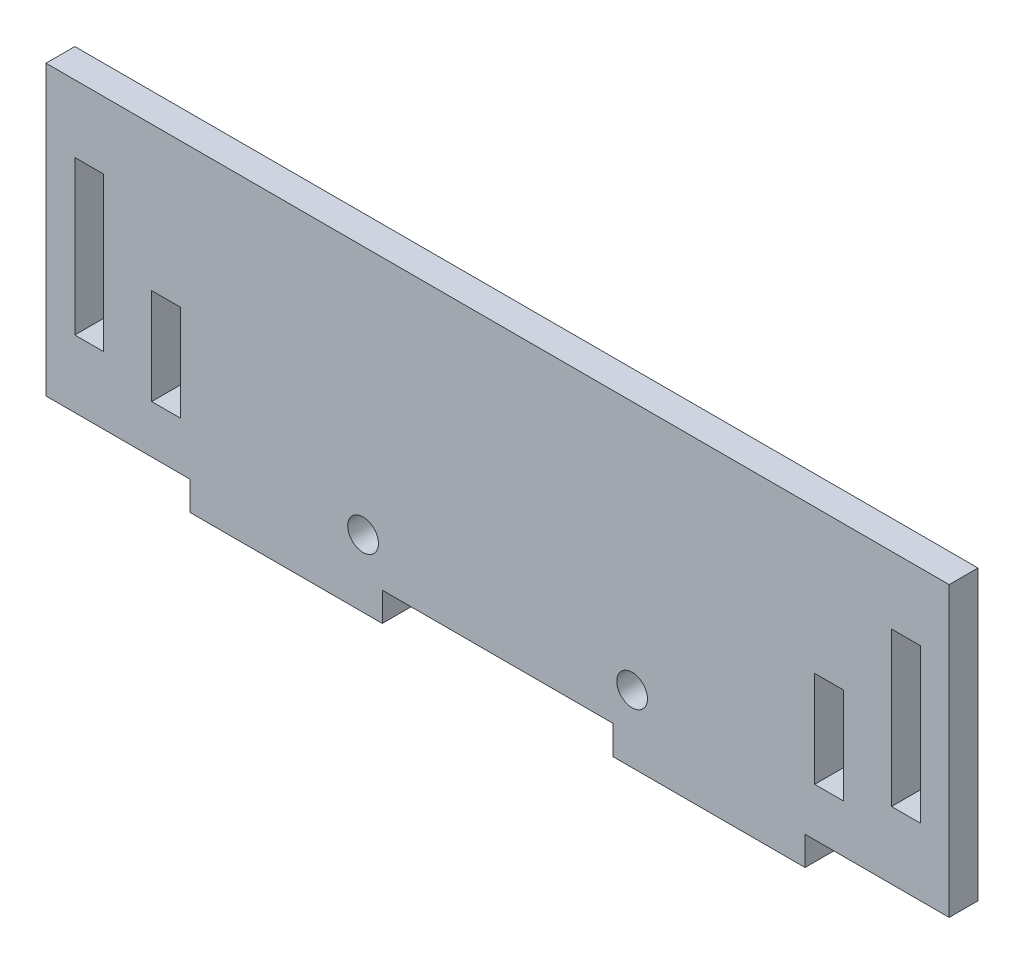
ISO-10303-21;
HEADER;
FILE_DESCRIPTION(('STEP AP214'),'2;1');
FILE_NAME('part.step','',(''),(''),'','','');
FILE_SCHEMA(('AUTOMOTIVE_DESIGN { 1 0 10303 214 1 1 1 1 }'));
ENDSEC;
DATA;
#1=APPLICATION_CONTEXT('core data for automotive mechanical design processes');
#2=APPLICATION_PROTOCOL_DEFINITION('international standard','automotive_design',2000,#1);
#3=PRODUCT_CONTEXT('',#1,'mechanical');
#4=PRODUCT('Part','Part','',(#3));
#5=PRODUCT_RELATED_PRODUCT_CATEGORY('part','',(#4));
#6=PRODUCT_DEFINITION_FORMATION('','',#4);
#7=PRODUCT_DEFINITION_CONTEXT('part definition',#1,'design');
#8=PRODUCT_DEFINITION('design','',#6,#7);
#9=PRODUCT_DEFINITION_SHAPE('','',#8);
#10=(LENGTH_UNIT() NAMED_UNIT(*) SI_UNIT(.MILLI.,.METRE.));
#11=(NAMED_UNIT(*) PLANE_ANGLE_UNIT() SI_UNIT($,.RADIAN.));
#12=(NAMED_UNIT(*) SI_UNIT($,.STERADIAN.) SOLID_ANGLE_UNIT());
#13=UNCERTAINTY_MEASURE_WITH_UNIT(LENGTH_MEASURE(1.E-05),#10,'distance_accuracy_value','');
#14=(GEOMETRIC_REPRESENTATION_CONTEXT(3) GLOBAL_UNCERTAINTY_ASSIGNED_CONTEXT((#13)) GLOBAL_UNIT_ASSIGNED_CONTEXT((#10,
#11,#12)) REPRESENTATION_CONTEXT('',''));
#15=CARTESIAN_POINT('',(0.,0.,0.));
#16=DIRECTION('',(0.,0.,1.));
#17=DIRECTION('',(1.,0.,0.));
#18=AXIS2_PLACEMENT_3D('',#15,#16,#17);
#19=CARTESIAN_POINT('',(0.,0.,3.));
#20=DIRECTION('',(-1.,0.,0.));
#21=DIRECTION('',(0.,0.,1.));
#22=AXIS2_PLACEMENT_3D('',#19,#20,#21);
#23=PLANE('',#22);
#24=DIRECTION('',(0.,1.,0.));
#25=VECTOR('',#24,1.);
#26=CARTESIAN_POINT('',(0.,0.,0.));
#27=LINE('',#26,#25);
#28=CARTESIAN_POINT('',(0.,7.,0.));
#29=VERTEX_POINT('',#28);
#30=CARTESIAN_POINT('',(0.,23.,0.));
#31=VERTEX_POINT('',#30);
#32=EDGE_CURVE('E329',#29,#31,#27,.T.);
#33=ORIENTED_EDGE('',*,*,#32,.T.);
#34=DIRECTION('',(0.,0.,-1.));
#35=VECTOR('',#34,1.);
#36=CARTESIAN_POINT('',(0.,23.,3.));
#37=LINE('',#36,#35);
#38=CARTESIAN_POINT('',(0.,23.,3.));
#39=VERTEX_POINT('',#38);
#40=EDGE_CURVE('E11',#39,#31,#37,.T.);
#41=ORIENTED_EDGE('',*,*,#40,.F.);
#42=DIRECTION('',(0.,1.,0.));
#43=VECTOR('',#42,1.);
#44=CARTESIAN_POINT('',(0.,0.,3.));
#45=LINE('',#44,#43);
#46=CARTESIAN_POINT('',(0.,7.,3.));
#47=VERTEX_POINT('',#46);
#48=EDGE_CURVE('E234',#47,#39,#45,.T.);
#49=ORIENTED_EDGE('',*,*,#48,.F.);
#50=DIRECTION('',(0.,0.,-1.));
#51=VECTOR('',#50,1.);
#52=CARTESIAN_POINT('',(0.,7.,3.));
#53=LINE('',#52,#51);
#54=EDGE_CURVE('E54',#47,#29,#53,.T.);
#55=ORIENTED_EDGE('',*,*,#54,.T.);
#56=EDGE_LOOP('',(#33,#41,#49,#55));
#57=FACE_BOUND('',#56,.T.);
#58=ADVANCED_FACE('F35',(#57),#23,.F.);
#59=CARTESIAN_POINT('',(0.,23.,3.));
#60=DIRECTION('',(0.,1.,0.));
#61=DIRECTION('',(0.,0.,1.));
#62=AXIS2_PLACEMENT_3D('',#59,#60,#61);
#63=PLANE('',#62);
#64=DIRECTION('',(1.,0.,0.));
#65=VECTOR('',#64,1.);
#66=CARTESIAN_POINT('',(0.,23.,0.));
#67=LINE('',#66,#65);
#68=CARTESIAN_POINT('',(3.,23.,0.));
#69=VERTEX_POINT('',#68);
#70=EDGE_CURVE('E240',#31,#69,#67,.T.);
#71=ORIENTED_EDGE('',*,*,#70,.T.);
#72=DIRECTION('',(0.,0.,-1.));
#73=VECTOR('',#72,1.);
#74=CARTESIAN_POINT('',(3.,23.,3.));
#75=LINE('',#74,#73);
#76=CARTESIAN_POINT('',(3.,23.,3.));
#77=VERTEX_POINT('',#76);
#78=EDGE_CURVE('E45',#77,#69,#75,.T.);
#79=ORIENTED_EDGE('',*,*,#78,.F.);
#80=DIRECTION('',(1.,0.,0.));
#81=VECTOR('',#80,1.);
#82=CARTESIAN_POINT('',(0.,23.,3.));
#83=LINE('',#82,#81);
#84=EDGE_CURVE('E228',#39,#77,#83,.T.);
#85=ORIENTED_EDGE('',*,*,#84,.F.);
#86=ORIENTED_EDGE('',*,*,#40,.T.);
#87=EDGE_LOOP('',(#71,#79,#85,#86));
#88=FACE_BOUND('',#87,.T.);
#89=ADVANCED_FACE('F239',(#88),#63,.F.);
#90=CARTESIAN_POINT('',(3.,0.,3.));
#91=DIRECTION('',(-1.,0.,0.));
#92=DIRECTION('',(0.,0.,1.));
#93=AXIS2_PLACEMENT_3D('',#90,#91,#92);
#94=PLANE('',#93);
#95=DIRECTION('',(0.,1.,0.));
#96=VECTOR('',#95,1.);
#97=CARTESIAN_POINT('',(3.,0.,0.));
#98=LINE('',#97,#96);
#99=CARTESIAN_POINT('',(3.,7.,0.));
#100=VERTEX_POINT('',#99);
#101=EDGE_CURVE('E332',#100,#69,#98,.T.);
#102=ORIENTED_EDGE('',*,*,#101,.F.);
#103=DIRECTION('',(0.,0.,-1.));
#104=VECTOR('',#103,1.);
#105=CARTESIAN_POINT('',(3.,7.,3.));
#106=LINE('',#105,#104);
#107=CARTESIAN_POINT('',(3.,7.,3.));
#108=VERTEX_POINT('',#107);
#109=EDGE_CURVE('E140',#108,#100,#106,.T.);
#110=ORIENTED_EDGE('',*,*,#109,.F.);
#111=DIRECTION('',(0.,1.,0.));
#112=VECTOR('',#111,1.);
#113=CARTESIAN_POINT('',(3.,0.,3.));
#114=LINE('',#113,#112);
#115=EDGE_CURVE('E233',#108,#77,#114,.T.);
#116=ORIENTED_EDGE('',*,*,#115,.T.);
#117=ORIENTED_EDGE('',*,*,#78,.T.);
#118=EDGE_LOOP('',(#102,#110,#116,#117));
#119=FACE_BOUND('',#118,.T.);
#120=ADVANCED_FACE('F244',(#119),#94,.T.);
#121=CARTESIAN_POINT('',(8.,0.,3.));
#122=DIRECTION('',(1.,0.,0.));
#123=DIRECTION('',(0.,0.,-1.));
#124=AXIS2_PLACEMENT_3D('',#121,#122,#123);
#125=PLANE('',#124);
#126=DIRECTION('',(0.,-1.,0.));
#127=VECTOR('',#126,1.);
#128=CARTESIAN_POINT('',(8.,0.,0.));
#129=LINE('',#128,#127);
#130=CARTESIAN_POINT('',(8.,15.,0.));
#131=VERTEX_POINT('',#130);
#132=CARTESIAN_POINT('',(8.,5.,0.));
#133=VERTEX_POINT('',#132);
#134=EDGE_CURVE('E317',#131,#133,#129,.T.);
#135=ORIENTED_EDGE('',*,*,#134,.F.);
#136=DIRECTION('',(0.,0.,-1.));
#137=VECTOR('',#136,1.);
#138=CARTESIAN_POINT('',(8.,15.,3.));
#139=LINE('',#138,#137);
#140=CARTESIAN_POINT('',(8.,15.,3.));
#141=VERTEX_POINT('',#140);
#142=EDGE_CURVE('E339',#141,#131,#139,.T.);
#143=ORIENTED_EDGE('',*,*,#142,.F.);
#144=DIRECTION('',(0.,-1.,0.));
#145=VECTOR('',#144,1.);
#146=CARTESIAN_POINT('',(8.,0.,3.));
#147=LINE('',#146,#145);
#148=CARTESIAN_POINT('',(8.,5.,3.));
#149=VERTEX_POINT('',#148);
#150=EDGE_CURVE('E492',#141,#149,#147,.T.);
#151=ORIENTED_EDGE('',*,*,#150,.T.);
#152=DIRECTION('',(0.,0.,-1.));
#153=VECTOR('',#152,1.);
#154=CARTESIAN_POINT('',(8.,5.,3.));
#155=LINE('',#154,#153);
#156=EDGE_CURVE('E341',#149,#133,#155,.T.);
#157=ORIENTED_EDGE('',*,*,#156,.T.);
#158=EDGE_LOOP('',(#135,#143,#151,#157));
#159=FACE_BOUND('',#158,.T.);
#160=ADVANCED_FACE('F518',(#159),#125,.T.);
#161=CARTESIAN_POINT('',(0.,15.,3.));
#162=DIRECTION('',(0.,1.,0.));
#163=DIRECTION('',(0.,0.,1.));
#164=AXIS2_PLACEMENT_3D('',#161,#162,#163);
#165=PLANE('',#164);
#166=DIRECTION('',(1.,0.,0.));
#167=VECTOR('',#166,1.);
#168=CARTESIAN_POINT('',(0.,15.,0.));
#169=LINE('',#168,#167);
#170=CARTESIAN_POINT('',(11.,15.,0.));
#171=VERTEX_POINT('',#170);
#172=EDGE_CURVE('E320',#131,#171,#169,.T.);
#173=ORIENTED_EDGE('',*,*,#172,.T.);
#174=DIRECTION('',(0.,0.,-1.));
#175=VECTOR('',#174,1.);
#176=CARTESIAN_POINT('',(11.,15.,3.));
#177=LINE('',#176,#175);
#178=CARTESIAN_POINT('',(11.,15.,3.));
#179=VERTEX_POINT('',#178);
#180=EDGE_CURVE('E346',#179,#171,#177,.T.);
#181=ORIENTED_EDGE('',*,*,#180,.F.);
#182=DIRECTION('',(1.,0.,0.));
#183=VECTOR('',#182,1.);
#184=CARTESIAN_POINT('',(0.,15.,3.));
#185=LINE('',#184,#183);
#186=EDGE_CURVE('E495',#141,#179,#185,.T.);
#187=ORIENTED_EDGE('',*,*,#186,.F.);
#188=ORIENTED_EDGE('',*,*,#142,.T.);
#189=EDGE_LOOP('',(#173,#181,#187,#188));
#190=FACE_BOUND('',#189,.T.);
#191=ADVANCED_FACE('F520',(#190),#165,.F.);
#192=CARTESIAN_POINT('',(11.,0.,3.));
#193=DIRECTION('',(1.,0.,0.));
#194=DIRECTION('',(0.,0.,-1.));
#195=AXIS2_PLACEMENT_3D('',#192,#193,#194);
#196=PLANE('',#195);
#197=DIRECTION('',(0.,-1.,0.));
#198=VECTOR('',#197,1.);
#199=CARTESIAN_POINT('',(11.,0.,0.));
#200=LINE('',#199,#198);
#201=CARTESIAN_POINT('',(11.,5.,0.));
#202=VERTEX_POINT('',#201);
#203=EDGE_CURVE('E323',#171,#202,#200,.T.);
#204=ORIENTED_EDGE('',*,*,#203,.T.);
#205=DIRECTION('',(0.,0.,-1.));
#206=VECTOR('',#205,1.);
#207=CARTESIAN_POINT('',(11.,5.,3.));
#208=LINE('',#207,#206);
#209=CARTESIAN_POINT('',(11.,5.,3.));
#210=VERTEX_POINT('',#209);
#211=EDGE_CURVE('E343',#210,#202,#208,.T.);
#212=ORIENTED_EDGE('',*,*,#211,.F.);
#213=DIRECTION('',(0.,-1.,0.));
#214=VECTOR('',#213,1.);
#215=CARTESIAN_POINT('',(11.,0.,3.));
#216=LINE('',#215,#214);
#217=EDGE_CURVE('E498',#179,#210,#216,.T.);
#218=ORIENTED_EDGE('',*,*,#217,.F.);
#219=ORIENTED_EDGE('',*,*,#180,.T.);
#220=EDGE_LOOP('',(#204,#212,#218,#219));
#221=FACE_BOUND('',#220,.T.);
#222=ADVANCED_FACE('F512',(#221),#196,.F.);
#223=CARTESIAN_POINT('',(0.,23.,3.));
#224=DIRECTION('',(0.,-1.,0.));
#225=DIRECTION('',(0.,0.,-1.));
#226=AXIS2_PLACEMENT_3D('',#223,#224,#225);
#227=PLANE('',#226);
#228=DIRECTION('',(-1.,0.,0.));
#229=VECTOR('',#228,1.);
#230=CARTESIAN_POINT('',(0.,23.,0.));
#231=LINE('',#230,#229);
#232=CARTESIAN_POINT('',(88.,23.,0.));
#233=VERTEX_POINT('',#232);
#234=CARTESIAN_POINT('',(85.,23.,0.));
#235=VERTEX_POINT('',#234);
#236=EDGE_CURVE('E305',#233,#235,#231,.T.);
#237=ORIENTED_EDGE('',*,*,#236,.F.);
#238=DIRECTION('',(0.,0.,-1.));
#239=VECTOR('',#238,1.);
#240=CARTESIAN_POINT('',(88.,23.,3.));
#241=LINE('',#240,#239);
#242=CARTESIAN_POINT('',(88.,23.,3.));
#243=VERTEX_POINT('',#242);
#244=EDGE_CURVE('E344',#243,#233,#241,.T.);
#245=ORIENTED_EDGE('',*,*,#244,.F.);
#246=DIRECTION('',(-1.,0.,0.));
#247=VECTOR('',#246,1.);
#248=CARTESIAN_POINT('',(0.,23.,3.));
#249=LINE('',#248,#247);
#250=CARTESIAN_POINT('',(85.,23.,3.));
#251=VERTEX_POINT('',#250);
#252=EDGE_CURVE('E481',#243,#251,#249,.T.);
#253=ORIENTED_EDGE('',*,*,#252,.T.);
#254=DIRECTION('',(0.,0.,-1.));
#255=VECTOR('',#254,1.);
#256=CARTESIAN_POINT('',(85.,23.,3.));
#257=LINE('',#256,#255);
#258=EDGE_CURVE('E350',#251,#235,#257,.T.);
#259=ORIENTED_EDGE('',*,*,#258,.T.);
#260=EDGE_LOOP('',(#237,#245,#253,#259));
#261=FACE_BOUND('',#260,.T.);
#262=ADVANCED_FACE('F527',(#261),#227,.T.);
#263=CARTESIAN_POINT('',(88.,0.,3.));
#264=DIRECTION('',(-1.,0.,0.));
#265=DIRECTION('',(0.,0.,1.));
#266=AXIS2_PLACEMENT_3D('',#263,#264,#265);
#267=PLANE('',#266);
#268=DIRECTION('',(0.,1.,0.));
#269=VECTOR('',#268,1.);
#270=CARTESIAN_POINT('',(88.,0.,0.));
#271=LINE('',#270,#269);
#272=CARTESIAN_POINT('',(88.,7.,0.));
#273=VERTEX_POINT('',#272);
#274=EDGE_CURVE('E308',#273,#233,#271,.T.);
#275=ORIENTED_EDGE('',*,*,#274,.F.);
#276=DIRECTION('',(0.,0.,-1.));
#277=VECTOR('',#276,1.);
#278=CARTESIAN_POINT('',(88.,7.,3.));
#279=LINE('',#278,#277);
#280=CARTESIAN_POINT('',(88.,7.,3.));
#281=VERTEX_POINT('',#280);
#282=EDGE_CURVE('E355',#281,#273,#279,.T.);
#283=ORIENTED_EDGE('',*,*,#282,.F.);
#284=DIRECTION('',(0.,1.,0.));
#285=VECTOR('',#284,1.);
#286=CARTESIAN_POINT('',(88.,0.,3.));
#287=LINE('',#286,#285);
#288=EDGE_CURVE('E484',#281,#243,#287,.T.);
#289=ORIENTED_EDGE('',*,*,#288,.T.);
#290=ORIENTED_EDGE('',*,*,#244,.T.);
#291=EDGE_LOOP('',(#275,#283,#289,#290));
#292=FACE_BOUND('',#291,.T.);
#293=ADVANCED_FACE('F626',(#292),#267,.T.);
#294=CARTESIAN_POINT('',(0.,7.,3.));
#295=DIRECTION('',(0.,-1.,0.));
#296=DIRECTION('',(0.,0.,-1.));
#297=AXIS2_PLACEMENT_3D('',#294,#295,#296);
#298=PLANE('',#297);
#299=DIRECTION('',(-1.,0.,0.));
#300=VECTOR('',#299,1.);
#301=CARTESIAN_POINT('',(0.,7.,0.));
#302=LINE('',#301,#300);
#303=CARTESIAN_POINT('',(85.,7.,0.));
#304=VERTEX_POINT('',#303);
#305=EDGE_CURVE('E311',#273,#304,#302,.T.);
#306=ORIENTED_EDGE('',*,*,#305,.T.);
#307=DIRECTION('',(0.,0.,-1.));
#308=VECTOR('',#307,1.);
#309=CARTESIAN_POINT('',(85.,7.,3.));
#310=LINE('',#309,#308);
#311=CARTESIAN_POINT('',(85.,7.,3.));
#312=VERTEX_POINT('',#311);
#313=EDGE_CURVE('E352',#312,#304,#310,.T.);
#314=ORIENTED_EDGE('',*,*,#313,.F.);
#315=DIRECTION('',(-1.,0.,0.));
#316=VECTOR('',#315,1.);
#317=CARTESIAN_POINT('',(0.,7.,3.));
#318=LINE('',#317,#316);
#319=EDGE_CURVE('E487',#281,#312,#318,.T.);
#320=ORIENTED_EDGE('',*,*,#319,.F.);
#321=ORIENTED_EDGE('',*,*,#282,.T.);
#322=EDGE_LOOP('',(#306,#314,#320,#321));
#323=FACE_BOUND('',#322,.T.);
#324=ADVANCED_FACE('F637',(#323),#298,.F.);
#325=CARTESIAN_POINT('',(0.,15.,3.));
#326=DIRECTION('',(0.,-1.,0.));
#327=DIRECTION('',(0.,0.,-1.));
#328=AXIS2_PLACEMENT_3D('',#325,#326,#327);
#329=PLANE('',#328);
#330=DIRECTION('',(-1.,0.,0.));
#331=VECTOR('',#330,1.);
#332=CARTESIAN_POINT('',(0.,15.,0.));
#333=LINE('',#332,#331);
#334=CARTESIAN_POINT('',(80.,15.,0.));
#335=VERTEX_POINT('',#334);
#336=CARTESIAN_POINT('',(77.,15.,0.));
#337=VERTEX_POINT('',#336);
#338=EDGE_CURVE('E293',#335,#337,#333,.T.);
#339=ORIENTED_EDGE('',*,*,#338,.F.);
#340=DIRECTION('',(0.,0.,-1.));
#341=VECTOR('',#340,1.);
#342=CARTESIAN_POINT('',(80.,15.,3.));
#343=LINE('',#342,#341);
#344=CARTESIAN_POINT('',(80.,15.,3.));
#345=VERTEX_POINT('',#344);
#346=EDGE_CURVE('E353',#345,#335,#343,.T.);
#347=ORIENTED_EDGE('',*,*,#346,.F.);
#348=DIRECTION('',(-1.,0.,0.));
#349=VECTOR('',#348,1.);
#350=CARTESIAN_POINT('',(0.,15.,3.));
#351=LINE('',#350,#349);
#352=CARTESIAN_POINT('',(77.,15.,3.));
#353=VERTEX_POINT('',#352);
#354=EDGE_CURVE('E470',#345,#353,#351,.T.);
#355=ORIENTED_EDGE('',*,*,#354,.T.);
#356=DIRECTION('',(0.,0.,-1.));
#357=VECTOR('',#356,1.);
#358=CARTESIAN_POINT('',(77.,15.,3.));
#359=LINE('',#358,#357);
#360=EDGE_CURVE('E358',#353,#337,#359,.T.);
#361=ORIENTED_EDGE('',*,*,#360,.T.);
#362=EDGE_LOOP('',(#339,#347,#355,#361));
#363=FACE_BOUND('',#362,.T.);
#364=ADVANCED_FACE('F648',(#363),#329,.T.);
#365=CARTESIAN_POINT('',(80.,0.,3.));
#366=DIRECTION('',(1.,0.,0.));
#367=DIRECTION('',(0.,0.,-1.));
#368=AXIS2_PLACEMENT_3D('',#365,#366,#367);
#369=PLANE('',#368);
#370=DIRECTION('',(0.,-1.,0.));
#371=VECTOR('',#370,1.);
#372=CARTESIAN_POINT('',(80.,0.,0.));
#373=LINE('',#372,#371);
#374=CARTESIAN_POINT('',(80.,5.,0.));
#375=VERTEX_POINT('',#374);
#376=EDGE_CURVE('E296',#335,#375,#373,.T.);
#377=ORIENTED_EDGE('',*,*,#376,.T.);
#378=DIRECTION('',(0.,0.,-1.));
#379=VECTOR('',#378,1.);
#380=CARTESIAN_POINT('',(80.,5.,3.));
#381=LINE('',#380,#379);
#382=CARTESIAN_POINT('',(80.,5.,3.));
#383=VERTEX_POINT('',#382);
#384=EDGE_CURVE('E362',#383,#375,#381,.T.);
#385=ORIENTED_EDGE('',*,*,#384,.F.);
#386=DIRECTION('',(0.,-1.,0.));
#387=VECTOR('',#386,1.);
#388=CARTESIAN_POINT('',(80.,0.,3.));
#389=LINE('',#388,#387);
#390=EDGE_CURVE('E473',#345,#383,#389,.T.);
#391=ORIENTED_EDGE('',*,*,#390,.F.);
#392=ORIENTED_EDGE('',*,*,#346,.T.);
#393=EDGE_LOOP('',(#377,#385,#391,#392));
#394=FACE_BOUND('',#393,.T.);
#395=ADVANCED_FACE('F658',(#394),#369,.F.);
#396=CARTESIAN_POINT('',(0.,5.,3.));
#397=DIRECTION('',(0.,-1.,0.));
#398=DIRECTION('',(0.,0.,-1.));
#399=AXIS2_PLACEMENT_3D('',#396,#397,#398);
#400=PLANE('',#399);
#401=DIRECTION('',(-1.,0.,0.));
#402=VECTOR('',#401,1.);
#403=CARTESIAN_POINT('',(0.,5.,0.));
#404=LINE('',#403,#402);
#405=CARTESIAN_POINT('',(77.,5.,0.));
#406=VERTEX_POINT('',#405);
#407=EDGE_CURVE('E299',#375,#406,#404,.T.);
#408=ORIENTED_EDGE('',*,*,#407,.T.);
#409=DIRECTION('',(0.,0.,-1.));
#410=VECTOR('',#409,1.);
#411=CARTESIAN_POINT('',(77.,5.,3.));
#412=LINE('',#411,#410);
#413=CARTESIAN_POINT('',(77.,5.,3.));
#414=VERTEX_POINT('',#413);
#415=EDGE_CURVE('E360',#414,#406,#412,.T.);
#416=ORIENTED_EDGE('',*,*,#415,.F.);
#417=DIRECTION('',(-1.,0.,0.));
#418=VECTOR('',#417,1.);
#419=CARTESIAN_POINT('',(0.,5.,3.));
#420=LINE('',#419,#418);
#421=EDGE_CURVE('E476',#383,#414,#420,.T.);
#422=ORIENTED_EDGE('',*,*,#421,.F.);
#423=ORIENTED_EDGE('',*,*,#384,.T.);
#424=EDGE_LOOP('',(#408,#416,#422,#423));
#425=FACE_BOUND('',#424,.T.);
#426=ADVANCED_FACE('F572',(#425),#400,.F.);
#427=CARTESIAN_POINT('',(0.,30.,3.));
#428=DIRECTION('',(0.,1.,0.));
#429=DIRECTION('',(0.,0.,1.));
#430=AXIS2_PLACEMENT_3D('',#427,#428,#429);
#431=PLANE('',#430);
#432=DIRECTION('',(1.,0.,0.));
#433=VECTOR('',#432,1.);
#434=CARTESIAN_POINT('',(0.,30.,0.));
#435=LINE('',#434,#433);
#436=CARTESIAN_POINT('',(-3.,30.,0.));
#437=VERTEX_POINT('',#436);
#438=CARTESIAN_POINT('',(91.,30.,0.));
#439=VERTEX_POINT('',#438);
#440=EDGE_CURVE('E257',#437,#439,#435,.T.);
#441=ORIENTED_EDGE('',*,*,#440,.F.);
#442=DIRECTION('',(0.,0.,-1.));
#443=VECTOR('',#442,1.);
#444=CARTESIAN_POINT('',(-3.,30.,3.));
#445=LINE('',#444,#443);
#446=CARTESIAN_POINT('',(-3.,30.,3.));
#447=VERTEX_POINT('',#446);
#448=EDGE_CURVE('E39',#447,#437,#445,.T.);
#449=ORIENTED_EDGE('',*,*,#448,.F.);
#450=DIRECTION('',(1.,0.,0.));
#451=VECTOR('',#450,1.);
#452=CARTESIAN_POINT('',(0.,30.,3.));
#453=LINE('',#452,#451);
#454=CARTESIAN_POINT('',(91.,30.,3.));
#455=VERTEX_POINT('',#454);
#456=EDGE_CURVE('E403',#447,#455,#453,.T.);
#457=ORIENTED_EDGE('',*,*,#456,.T.);
#458=DIRECTION('',(0.,0.,-1.));
#459=VECTOR('',#458,1.);
#460=CARTESIAN_POINT('',(91.,30.,3.));
#461=LINE('',#460,#459);
#462=EDGE_CURVE('E247',#455,#439,#461,.T.);
#463=ORIENTED_EDGE('',*,*,#462,.T.);
#464=EDGE_LOOP('',(#441,#449,#457,#463));
#465=FACE_BOUND('',#464,.T.);
#466=ADVANCED_FACE('F402',(#465),#431,.T.);
#467=CARTESIAN_POINT('',(-3.,0.,3.));
#468=DIRECTION('',(1.,0.,0.));
#469=DIRECTION('',(0.,0.,-1.));
#470=AXIS2_PLACEMENT_3D('',#467,#468,#469);
#471=PLANE('',#470);
#472=DIRECTION('',(0.,-1.,0.));
#473=VECTOR('',#472,1.);
#474=CARTESIAN_POINT('',(-3.,0.,0.));
#475=LINE('',#474,#473);
#476=CARTESIAN_POINT('',(-3.,0.,0.));
#477=VERTEX_POINT('',#476);
#478=EDGE_CURVE('E260',#437,#477,#475,.T.);
#479=ORIENTED_EDGE('',*,*,#478,.T.);
#480=DIRECTION('',(0.,0.,-1.));
#481=VECTOR('',#480,1.);
#482=CARTESIAN_POINT('',(-3.,0.,3.));
#483=LINE('',#482,#481);
#484=CARTESIAN_POINT('',(-3.,0.,3.));
#485=VERTEX_POINT('',#484);
#486=EDGE_CURVE('E387',#485,#477,#483,.T.);
#487=ORIENTED_EDGE('',*,*,#486,.F.);
#488=DIRECTION('',(0.,-1.,0.));
#489=VECTOR('',#488,1.);
#490=CARTESIAN_POINT('',(-3.,0.,3.));
#491=LINE('',#490,#489);
#492=EDGE_CURVE('E395',#447,#485,#491,.T.);
#493=ORIENTED_EDGE('',*,*,#492,.F.);
#494=ORIENTED_EDGE('',*,*,#448,.T.);
#495=EDGE_LOOP('',(#479,#487,#493,#494));
#496=FACE_BOUND('',#495,.T.);
#497=ADVANCED_FACE('F394',(#496),#471,.F.);
#498=CARTESIAN_POINT('',(0.,0.,3.));
#499=DIRECTION('',(0.,-1.,0.));
#500=DIRECTION('',(0.,0.,-1.));
#501=AXIS2_PLACEMENT_3D('',#498,#499,#500);
#502=PLANE('',#501);
#503=DIRECTION('',(-1.,0.,0.));
#504=VECTOR('',#503,1.);
#505=CARTESIAN_POINT('',(0.,0.,0.));
#506=LINE('',#505,#504);
#507=CARTESIAN_POINT('',(12.,0.,0.));
#508=VERTEX_POINT('',#507);
#509=EDGE_CURVE('E263',#508,#477,#506,.T.);
#510=ORIENTED_EDGE('',*,*,#509,.F.);
#511=DIRECTION('',(0.,0.,-1.));
#512=VECTOR('',#511,1.);
#513=CARTESIAN_POINT('',(12.,0.,3.));
#514=LINE('',#513,#512);
#515=CARTESIAN_POINT('',(12.,0.,3.));
#516=VERTEX_POINT('',#515);
#517=EDGE_CURVE('E386',#516,#508,#514,.T.);
#518=ORIENTED_EDGE('',*,*,#517,.F.);
#519=DIRECTION('',(-1.,0.,0.));
#520=VECTOR('',#519,1.);
#521=CARTESIAN_POINT('',(0.,0.,3.));
#522=LINE('',#521,#520);
#523=EDGE_CURVE('E453',#516,#485,#522,.T.);
#524=ORIENTED_EDGE('',*,*,#523,.T.);
#525=ORIENTED_EDGE('',*,*,#486,.T.);
#526=EDGE_LOOP('',(#510,#518,#524,#525));
#527=FACE_BOUND('',#526,.T.);
#528=ADVANCED_FACE('F452',(#527),#502,.T.);
#529=CARTESIAN_POINT('',(12.,0.,3.));
#530=DIRECTION('',(1.,0.,0.));
#531=DIRECTION('',(0.,0.,-1.));
#532=AXIS2_PLACEMENT_3D('',#529,#530,#531);
#533=PLANE('',#532);
#534=DIRECTION('',(0.,-1.,0.));
#535=VECTOR('',#534,1.);
#536=CARTESIAN_POINT('',(12.,0.,0.));
#537=LINE('',#536,#535);
#538=CARTESIAN_POINT('',(12.,-3.,0.));
#539=VERTEX_POINT('',#538);
#540=EDGE_CURVE('E266',#508,#539,#537,.T.);
#541=ORIENTED_EDGE('',*,*,#540,.T.);
#542=DIRECTION('',(0.,0.,-1.));
#543=VECTOR('',#542,1.);
#544=CARTESIAN_POINT('',(12.,-3.,3.));
#545=LINE('',#544,#543);
#546=CARTESIAN_POINT('',(12.,-3.,3.));
#547=VERTEX_POINT('',#546);
#548=EDGE_CURVE('E383',#547,#539,#545,.T.);
#549=ORIENTED_EDGE('',*,*,#548,.F.);
#550=DIRECTION('',(0.,-1.,0.));
#551=VECTOR('',#550,1.);
#552=CARTESIAN_POINT('',(12.,0.,3.));
#553=LINE('',#552,#551);
#554=EDGE_CURVE('E450',#516,#547,#553,.T.);
#555=ORIENTED_EDGE('',*,*,#554,.F.);
#556=ORIENTED_EDGE('',*,*,#517,.T.);
#557=EDGE_LOOP('',(#541,#549,#555,#556));
#558=FACE_BOUND('',#557,.T.);
#559=ADVANCED_FACE('F449',(#558),#533,.F.);
#560=CARTESIAN_POINT('',(0.,-3.,3.));
#561=DIRECTION('',(0.,1.,0.));
#562=DIRECTION('',(0.,0.,1.));
#563=AXIS2_PLACEMENT_3D('',#560,#561,#562);
#564=PLANE('',#563);
#565=DIRECTION('',(1.,0.,0.));
#566=VECTOR('',#565,1.);
#567=CARTESIAN_POINT('',(0.,-3.,0.));
#568=LINE('',#567,#566);
#569=CARTESIAN_POINT('',(32.,-3.,0.));
#570=VERTEX_POINT('',#569);
#571=EDGE_CURVE('E269',#539,#570,#568,.T.);
#572=ORIENTED_EDGE('',*,*,#571,.T.);
#573=DIRECTION('',(0.,0.,-1.));
#574=VECTOR('',#573,1.);
#575=CARTESIAN_POINT('',(32.,-3.,3.));
#576=LINE('',#575,#574);
#577=CARTESIAN_POINT('',(32.,-3.,3.));
#578=VERTEX_POINT('',#577);
#579=EDGE_CURVE('E380',#578,#570,#576,.T.);
#580=ORIENTED_EDGE('',*,*,#579,.F.);
#581=DIRECTION('',(1.,0.,0.));
#582=VECTOR('',#581,1.);
#583=CARTESIAN_POINT('',(0.,-3.,3.));
#584=LINE('',#583,#582);
#585=EDGE_CURVE('E445',#547,#578,#584,.T.);
#586=ORIENTED_EDGE('',*,*,#585,.F.);
#587=ORIENTED_EDGE('',*,*,#548,.T.);
#588=EDGE_LOOP('',(#572,#580,#586,#587));
#589=FACE_BOUND('',#588,.T.);
#590=ADVANCED_FACE('F443',(#589),#564,.F.);
#591=CARTESIAN_POINT('',(32.,0.,3.));
#592=DIRECTION('',(-1.,0.,0.));
#593=DIRECTION('',(0.,0.,1.));
#594=AXIS2_PLACEMENT_3D('',#591,#592,#593);
#595=PLANE('',#594);
#596=DIRECTION('',(0.,1.,0.));
#597=VECTOR('',#596,1.);
#598=CARTESIAN_POINT('',(32.,0.,0.));
#599=LINE('',#598,#597);
#600=CARTESIAN_POINT('',(32.,0.,0.));
#601=VERTEX_POINT('',#600);
#602=EDGE_CURVE('E272',#570,#601,#599,.T.);
#603=ORIENTED_EDGE('',*,*,#602,.T.);
#604=DIRECTION('',(0.,0.,-1.));
#605=VECTOR('',#604,1.);
#606=CARTESIAN_POINT('',(32.,0.,3.));
#607=LINE('',#606,#605);
#608=CARTESIAN_POINT('',(32.,0.,3.));
#609=VERTEX_POINT('',#608);
#610=EDGE_CURVE('E377',#609,#601,#607,.T.);
#611=ORIENTED_EDGE('',*,*,#610,.F.);
#612=DIRECTION('',(0.,1.,0.));
#613=VECTOR('',#612,1.);
#614=CARTESIAN_POINT('',(32.,0.,3.));
#615=LINE('',#614,#613);
#616=EDGE_CURVE('E461',#578,#609,#615,.T.);
#617=ORIENTED_EDGE('',*,*,#616,.F.);
#618=ORIENTED_EDGE('',*,*,#579,.T.);
#619=EDGE_LOOP('',(#603,#611,#617,#618));
#620=FACE_BOUND('',#619,.T.);
#621=ADVANCED_FACE('F439',(#620),#595,.F.);
#622=CARTESIAN_POINT('',(0.,0.,3.));
#623=DIRECTION('',(0.,1.,0.));
#624=DIRECTION('',(0.,0.,1.));
#625=AXIS2_PLACEMENT_3D('',#622,#623,#624);
#626=PLANE('',#625);
#627=DIRECTION('',(1.,0.,0.));
#628=VECTOR('',#627,1.);
#629=CARTESIAN_POINT('',(0.,0.,0.));
#630=LINE('',#629,#628);
#631=CARTESIAN_POINT('',(56.,0.,0.));
#632=VERTEX_POINT('',#631);
#633=EDGE_CURVE('E275',#601,#632,#630,.T.);
#634=ORIENTED_EDGE('',*,*,#633,.T.);
#635=DIRECTION('',(0.,0.,-1.));
#636=VECTOR('',#635,1.);
#637=CARTESIAN_POINT('',(56.,0.,3.));
#638=LINE('',#637,#636);
#639=CARTESIAN_POINT('',(56.,0.,3.));
#640=VERTEX_POINT('',#639);
#641=EDGE_CURVE('E375',#640,#632,#638,.T.);
#642=ORIENTED_EDGE('',*,*,#641,.F.);
#643=DIRECTION('',(1.,0.,0.));
#644=VECTOR('',#643,1.);
#645=CARTESIAN_POINT('',(0.,0.,3.));
#646=LINE('',#645,#644);
#647=EDGE_CURVE('E436',#609,#640,#646,.T.);
#648=ORIENTED_EDGE('',*,*,#647,.F.);
#649=ORIENTED_EDGE('',*,*,#610,.T.);
#650=EDGE_LOOP('',(#634,#642,#648,#649));
#651=FACE_BOUND('',#650,.T.);
#652=ADVANCED_FACE('F434',(#651),#626,.F.);
#653=CARTESIAN_POINT('',(56.,0.,3.));
#654=DIRECTION('',(-1.,0.,0.));
#655=DIRECTION('',(0.,0.,1.));
#656=AXIS2_PLACEMENT_3D('',#653,#654,#655);
#657=PLANE('',#656);
#658=DIRECTION('',(0.,1.,0.));
#659=VECTOR('',#658,1.);
#660=CARTESIAN_POINT('',(56.,0.,0.));
#661=LINE('',#660,#659);
#662=CARTESIAN_POINT('',(56.,-3.,0.));
#663=VERTEX_POINT('',#662);
#664=EDGE_CURVE('E278',#663,#632,#661,.T.);
#665=ORIENTED_EDGE('',*,*,#664,.F.);
#666=DIRECTION('',(0.,0.,-1.));
#667=VECTOR('',#666,1.);
#668=CARTESIAN_POINT('',(56.,-3.,3.));
#669=LINE('',#668,#667);
#670=CARTESIAN_POINT('',(56.,-3.,3.));
#671=VERTEX_POINT('',#670);
#672=EDGE_CURVE('E373',#671,#663,#669,.T.);
#673=ORIENTED_EDGE('',*,*,#672,.F.);
#674=DIRECTION('',(0.,1.,0.));
#675=VECTOR('',#674,1.);
#676=CARTESIAN_POINT('',(56.,0.,3.));
#677=LINE('',#676,#675);
#678=EDGE_CURVE('E432',#671,#640,#677,.T.);
#679=ORIENTED_EDGE('',*,*,#678,.T.);
#680=ORIENTED_EDGE('',*,*,#641,.T.);
#681=EDGE_LOOP('',(#665,#673,#679,#680));
#682=FACE_BOUND('',#681,.T.);
#683=ADVANCED_FACE('F428',(#682),#657,.T.);
#684=CARTESIAN_POINT('',(0.,-3.,3.));
#685=DIRECTION('',(0.,-1.,0.));
#686=DIRECTION('',(0.,0.,-1.));
#687=AXIS2_PLACEMENT_3D('',#684,#685,#686);
#688=PLANE('',#687);
#689=DIRECTION('',(-1.,0.,0.));
#690=VECTOR('',#689,1.);
#691=CARTESIAN_POINT('',(0.,-3.,0.));
#692=LINE('',#691,#690);
#693=CARTESIAN_POINT('',(76.,-3.,0.));
#694=VERTEX_POINT('',#693);
#695=EDGE_CURVE('E281',#694,#663,#692,.T.);
#696=ORIENTED_EDGE('',*,*,#695,.F.);
#697=DIRECTION('',(0.,0.,-1.));
#698=VECTOR('',#697,1.);
#699=CARTESIAN_POINT('',(76.,-3.,3.));
#700=LINE('',#699,#698);
#701=CARTESIAN_POINT('',(76.,-3.,3.));
#702=VERTEX_POINT('',#701);
#703=EDGE_CURVE('E371',#702,#694,#700,.T.);
#704=ORIENTED_EDGE('',*,*,#703,.F.);
#705=DIRECTION('',(-1.,0.,0.));
#706=VECTOR('',#705,1.);
#707=CARTESIAN_POINT('',(0.,-3.,3.));
#708=LINE('',#707,#706);
#709=EDGE_CURVE('E465',#702,#671,#708,.T.);
#710=ORIENTED_EDGE('',*,*,#709,.T.);
#711=ORIENTED_EDGE('',*,*,#672,.T.);
#712=EDGE_LOOP('',(#696,#704,#710,#711));
#713=FACE_BOUND('',#712,.T.);
#714=ADVANCED_FACE('F425',(#713),#688,.T.);
#715=CARTESIAN_POINT('',(76.,0.,3.));
#716=DIRECTION('',(1.,0.,0.));
#717=DIRECTION('',(0.,0.,-1.));
#718=AXIS2_PLACEMENT_3D('',#715,#716,#717);
#719=PLANE('',#718);
#720=DIRECTION('',(0.,-1.,0.));
#721=VECTOR('',#720,1.);
#722=CARTESIAN_POINT('',(76.,0.,0.));
#723=LINE('',#722,#721);
#724=CARTESIAN_POINT('',(76.,0.,0.));
#725=VERTEX_POINT('',#724);
#726=EDGE_CURVE('E284',#725,#694,#723,.T.);
#727=ORIENTED_EDGE('',*,*,#726,.F.);
#728=DIRECTION('',(0.,0.,-1.));
#729=VECTOR('',#728,1.);
#730=CARTESIAN_POINT('',(76.,0.,3.));
#731=LINE('',#730,#729);
#732=CARTESIAN_POINT('',(76.,0.,3.));
#733=VERTEX_POINT('',#732);
#734=EDGE_CURVE('E369',#733,#725,#731,.T.);
#735=ORIENTED_EDGE('',*,*,#734,.F.);
#736=DIRECTION('',(0.,-1.,0.));
#737=VECTOR('',#736,1.);
#738=CARTESIAN_POINT('',(76.,0.,3.));
#739=LINE('',#738,#737);
#740=EDGE_CURVE('E421',#733,#702,#739,.T.);
#741=ORIENTED_EDGE('',*,*,#740,.T.);
#742=ORIENTED_EDGE('',*,*,#703,.T.);
#743=EDGE_LOOP('',(#727,#735,#741,#742));
#744=FACE_BOUND('',#743,.T.);
#745=ADVANCED_FACE('F419',(#744),#719,.T.);
#746=CARTESIAN_POINT('',(0.,0.,3.));
#747=DIRECTION('',(0.,-1.,0.));
#748=DIRECTION('',(0.,0.,-1.));
#749=AXIS2_PLACEMENT_3D('',#746,#747,#748);
#750=PLANE('',#749);
#751=DIRECTION('',(-1.,0.,0.));
#752=VECTOR('',#751,1.);
#753=CARTESIAN_POINT('',(0.,0.,0.));
#754=LINE('',#753,#752);
#755=CARTESIAN_POINT('',(91.,0.,0.));
#756=VERTEX_POINT('',#755);
#757=EDGE_CURVE('E287',#756,#725,#754,.T.);
#758=ORIENTED_EDGE('',*,*,#757,.F.);
#759=DIRECTION('',(0.,0.,-1.));
#760=VECTOR('',#759,1.);
#761=CARTESIAN_POINT('',(91.,0.,3.));
#762=LINE('',#761,#760);
#763=CARTESIAN_POINT('',(91.,0.,3.));
#764=VERTEX_POINT('',#763);
#765=EDGE_CURVE('E367',#764,#756,#762,.T.);
#766=ORIENTED_EDGE('',*,*,#765,.F.);
#767=DIRECTION('',(-1.,0.,0.));
#768=VECTOR('',#767,1.);
#769=CARTESIAN_POINT('',(0.,0.,3.));
#770=LINE('',#769,#768);
#771=EDGE_CURVE('E415',#764,#733,#770,.T.);
#772=ORIENTED_EDGE('',*,*,#771,.T.);
#773=ORIENTED_EDGE('',*,*,#734,.T.);
#774=EDGE_LOOP('',(#758,#766,#772,#773));
#775=FACE_BOUND('',#774,.T.);
#776=ADVANCED_FACE('F412',(#775),#750,.T.);
#777=CARTESIAN_POINT('',(0.,5.,3.));
#778=DIRECTION('',(0.,1.,0.));
#779=DIRECTION('',(0.,0.,1.));
#780=AXIS2_PLACEMENT_3D('',#777,#778,#779);
#781=PLANE('',#780);
#782=DIRECTION('',(1.,0.,0.));
#783=VECTOR('',#782,1.);
#784=CARTESIAN_POINT('',(0.,5.,0.));
#785=LINE('',#784,#783);
#786=EDGE_CURVE('E326',#133,#202,#785,.T.);
#787=ORIENTED_EDGE('',*,*,#786,.F.);
#788=ORIENTED_EDGE('',*,*,#156,.F.);
#789=DIRECTION('',(1.,0.,0.));
#790=VECTOR('',#789,1.);
#791=CARTESIAN_POINT('',(0.,5.,3.));
#792=LINE('',#791,#790);
#793=EDGE_CURVE('E500',#149,#210,#792,.T.);
#794=ORIENTED_EDGE('',*,*,#793,.T.);
#795=ORIENTED_EDGE('',*,*,#211,.T.);
#796=EDGE_LOOP('',(#787,#788,#794,#795));
#797=FACE_BOUND('',#796,.T.);
#798=ADVANCED_FACE('F505',(#797),#781,.T.);
#799=CARTESIAN_POINT('',(85.,0.,3.));
#800=DIRECTION('',(1.,0.,0.));
#801=DIRECTION('',(0.,0.,-1.));
#802=AXIS2_PLACEMENT_3D('',#799,#800,#801);
#803=PLANE('',#802);
#804=DIRECTION('',(0.,-1.,0.));
#805=VECTOR('',#804,1.);
#806=CARTESIAN_POINT('',(85.,0.,0.));
#807=LINE('',#806,#805);
#808=EDGE_CURVE('E314',#235,#304,#807,.T.);
#809=ORIENTED_EDGE('',*,*,#808,.F.);
#810=ORIENTED_EDGE('',*,*,#258,.F.);
#811=DIRECTION('',(0.,-1.,0.));
#812=VECTOR('',#811,1.);
#813=CARTESIAN_POINT('',(85.,0.,3.));
#814=LINE('',#813,#812);
#815=EDGE_CURVE('E489',#251,#312,#814,.T.);
#816=ORIENTED_EDGE('',*,*,#815,.T.);
#817=ORIENTED_EDGE('',*,*,#313,.T.);
#818=EDGE_LOOP('',(#809,#810,#816,#817));
#819=FACE_BOUND('',#818,.T.);
#820=ADVANCED_FACE('F539',(#819),#803,.T.);
#821=CARTESIAN_POINT('',(77.,0.,3.));
#822=DIRECTION('',(1.,0.,0.));
#823=DIRECTION('',(0.,0.,-1.));
#824=AXIS2_PLACEMENT_3D('',#821,#822,#823);
#825=PLANE('',#824);
#826=DIRECTION('',(0.,-1.,0.));
#827=VECTOR('',#826,1.);
#828=CARTESIAN_POINT('',(77.,0.,0.));
#829=LINE('',#828,#827);
#830=EDGE_CURVE('E302',#337,#406,#829,.T.);
#831=ORIENTED_EDGE('',*,*,#830,.F.);
#832=ORIENTED_EDGE('',*,*,#360,.F.);
#833=DIRECTION('',(0.,-1.,0.));
#834=VECTOR('',#833,1.);
#835=CARTESIAN_POINT('',(77.,0.,3.));
#836=LINE('',#835,#834);
#837=EDGE_CURVE('E478',#353,#414,#836,.T.);
#838=ORIENTED_EDGE('',*,*,#837,.T.);
#839=ORIENTED_EDGE('',*,*,#415,.T.);
#840=EDGE_LOOP('',(#831,#832,#838,#839));
#841=FACE_BOUND('',#840,.T.);
#842=ADVANCED_FACE('F544',(#841),#825,.T.);
#843=CARTESIAN_POINT('',(91.,0.,3.));
#844=DIRECTION('',(1.,0.,0.));
#845=DIRECTION('',(0.,0.,-1.));
#846=AXIS2_PLACEMENT_3D('',#843,#844,#845);
#847=PLANE('',#846);
#848=DIRECTION('',(0.,-1.,0.));
#849=VECTOR('',#848,1.);
#850=CARTESIAN_POINT('',(91.,0.,0.));
#851=LINE('',#850,#849);
#852=EDGE_CURVE('E290',#439,#756,#851,.T.);
#853=ORIENTED_EDGE('',*,*,#852,.F.);
#854=ORIENTED_EDGE('',*,*,#462,.F.);
#855=DIRECTION('',(0.,-1.,0.));
#856=VECTOR('',#855,1.);
#857=CARTESIAN_POINT('',(91.,0.,3.));
#858=LINE('',#857,#856);
#859=EDGE_CURVE('E408',#455,#764,#858,.T.);
#860=ORIENTED_EDGE('',*,*,#859,.T.);
#861=ORIENTED_EDGE('',*,*,#765,.T.);
#862=EDGE_LOOP('',(#853,#854,#860,#861));
#863=FACE_BOUND('',#862,.T.);
#864=ADVANCED_FACE('F407',(#863),#847,.T.);
#865=CARTESIAN_POINT('',(58.,4.,3.));
#866=DIRECTION('',(0.,0.,-1.));
#867=DIRECTION('',(-1.,0.,0.));
#868=AXIS2_PLACEMENT_3D('',#865,#866,#867);
#869=CYLINDRICAL_SURFACE('',#868,1.6);
#870=CARTESIAN_POINT('',(58.,4.,3.));
#871=DIRECTION('',(0.,0.,1.));
#872=DIRECTION('',(1.,0.,0.));
#873=AXIS2_PLACEMENT_3D('',#870,#871,#872);
#874=CIRCLE('',#873,1.6);
#875=CARTESIAN_POINT('',(59.6,4.,3.));
#876=VERTEX_POINT('',#875);
#877=EDGE_CURVE('E585',#876,#876,#874,.T.);
#878=ORIENTED_EDGE('',*,*,#877,.T.);
#879=EDGE_LOOP('',(#878));
#880=FACE_BOUND('',#879,.T.);
#881=CARTESIAN_POINT('',(58.,4.,0.));
#882=DIRECTION('',(0.,0.,1.));
#883=DIRECTION('',(1.,0.,0.));
#884=AXIS2_PLACEMENT_3D('',#881,#882,#883);
#885=CIRCLE('',#884,1.6);
#886=CARTESIAN_POINT('',(59.6,4.,0.));
#887=VERTEX_POINT('',#886);
#888=EDGE_CURVE('E254',#887,#887,#885,.T.);
#889=ORIENTED_EDGE('',*,*,#888,.F.);
#890=EDGE_LOOP('',(#889));
#891=FACE_BOUND('',#890,.T.);
#892=ADVANCED_FACE('F573',(#880,#891),#869,.F.);
#893=CARTESIAN_POINT('',(30.,4.,3.));
#894=DIRECTION('',(0.,0.,-1.));
#895=DIRECTION('',(-1.,0.,0.));
#896=AXIS2_PLACEMENT_3D('',#893,#894,#895);
#897=CYLINDRICAL_SURFACE('',#896,1.6);
#898=CARTESIAN_POINT('',(30.,4.,3.));
#899=DIRECTION('',(0.,0.,1.));
#900=DIRECTION('',(1.,0.,0.));
#901=AXIS2_PLACEMENT_3D('',#898,#899,#900);
#902=CIRCLE('',#901,1.6);
#903=CARTESIAN_POINT('',(31.6,4.,3.));
#904=VERTEX_POINT('',#903);
#905=EDGE_CURVE('E337',#904,#904,#902,.T.);
#906=ORIENTED_EDGE('',*,*,#905,.T.);
#907=EDGE_LOOP('',(#906));
#908=FACE_BOUND('',#907,.T.);
#909=CARTESIAN_POINT('',(30.,4.,0.));
#910=DIRECTION('',(0.,0.,1.));
#911=DIRECTION('',(1.,0.,0.));
#912=AXIS2_PLACEMENT_3D('',#909,#910,#911);
#913=CIRCLE('',#912,1.6);
#914=CARTESIAN_POINT('',(31.6,4.,0.));
#915=VERTEX_POINT('',#914);
#916=EDGE_CURVE('E251',#915,#915,#913,.T.);
#917=ORIENTED_EDGE('',*,*,#916,.F.);
#918=EDGE_LOOP('',(#917));
#919=FACE_BOUND('',#918,.T.);
#920=ADVANCED_FACE('F37',(#908,#919),#897,.F.);
#921=CARTESIAN_POINT('',(0.,7.,3.));
#922=DIRECTION('',(0.,1.,0.));
#923=DIRECTION('',(0.,0.,1.));
#924=AXIS2_PLACEMENT_3D('',#921,#922,#923);
#925=PLANE('',#924);
#926=DIRECTION('',(1.,0.,0.));
#927=VECTOR('',#926,1.);
#928=CARTESIAN_POINT('',(0.,7.,0.));
#929=LINE('',#928,#927);
#930=EDGE_CURVE('E334',#29,#100,#929,.T.);
#931=ORIENTED_EDGE('',*,*,#930,.F.);
#932=ORIENTED_EDGE('',*,*,#54,.F.);
#933=DIRECTION('',(1.,0.,0.));
#934=VECTOR('',#933,1.);
#935=CARTESIAN_POINT('',(0.,7.,3.));
#936=LINE('',#935,#934);
#937=EDGE_CURVE('E245',#47,#108,#936,.T.);
#938=ORIENTED_EDGE('',*,*,#937,.T.);
#939=ORIENTED_EDGE('',*,*,#109,.T.);
#940=EDGE_LOOP('',(#931,#932,#938,#939));
#941=FACE_BOUND('',#940,.T.);
#942=ADVANCED_FACE('F580',(#941),#925,.T.);
#943=CARTESIAN_POINT('',(0.,0.,3.));
#944=DIRECTION('',(0.,0.,1.));
#945=DIRECTION('',(1.,0.,0.));
#946=AXIS2_PLACEMENT_3D('',#943,#944,#945);
#947=PLANE('',#946);
#948=ORIENTED_EDGE('',*,*,#905,.F.);
#949=EDGE_LOOP('',(#948));
#950=FACE_BOUND('',#949,.T.);
#951=ORIENTED_EDGE('',*,*,#877,.F.);
#952=EDGE_LOOP('',(#951));
#953=FACE_BOUND('',#952,.T.);
#954=ORIENTED_EDGE('',*,*,#456,.F.);
#955=ORIENTED_EDGE('',*,*,#492,.T.);
#956=ORIENTED_EDGE('',*,*,#523,.F.);
#957=ORIENTED_EDGE('',*,*,#554,.T.);
#958=ORIENTED_EDGE('',*,*,#585,.T.);
#959=ORIENTED_EDGE('',*,*,#616,.T.);
#960=ORIENTED_EDGE('',*,*,#647,.T.);
#961=ORIENTED_EDGE('',*,*,#678,.F.);
#962=ORIENTED_EDGE('',*,*,#709,.F.);
#963=ORIENTED_EDGE('',*,*,#740,.F.);
#964=ORIENTED_EDGE('',*,*,#771,.F.);
#965=ORIENTED_EDGE('',*,*,#859,.F.);
#966=EDGE_LOOP('',(#954,#955,#956,#957,#958,#959,#960,#961,#962,#963,#964,#965));
#967=FACE_BOUND('',#966,.T.);
#968=ORIENTED_EDGE('',*,*,#354,.F.);
#969=ORIENTED_EDGE('',*,*,#390,.T.);
#970=ORIENTED_EDGE('',*,*,#421,.T.);
#971=ORIENTED_EDGE('',*,*,#837,.F.);
#972=EDGE_LOOP('',(#968,#969,#970,#971));
#973=FACE_BOUND('',#972,.T.);
#974=ORIENTED_EDGE('',*,*,#252,.F.);
#975=ORIENTED_EDGE('',*,*,#288,.F.);
#976=ORIENTED_EDGE('',*,*,#319,.T.);
#977=ORIENTED_EDGE('',*,*,#815,.F.);
#978=EDGE_LOOP('',(#974,#975,#976,#977));
#979=FACE_BOUND('',#978,.T.);
#980=ORIENTED_EDGE('',*,*,#150,.F.);
#981=ORIENTED_EDGE('',*,*,#186,.T.);
#982=ORIENTED_EDGE('',*,*,#217,.T.);
#983=ORIENTED_EDGE('',*,*,#793,.F.);
#984=EDGE_LOOP('',(#980,#981,#982,#983));
#985=FACE_BOUND('',#984,.T.);
#986=ORIENTED_EDGE('',*,*,#48,.T.);
#987=ORIENTED_EDGE('',*,*,#84,.T.);
#988=ORIENTED_EDGE('',*,*,#115,.F.);
#989=ORIENTED_EDGE('',*,*,#937,.F.);
#990=EDGE_LOOP('',(#986,#987,#988,#989));
#991=FACE_BOUND('',#990,.T.);
#992=ADVANCED_FACE('F230',(#950,#953,#967,#973,#979,#985,#991),#947,.T.);
#993=CARTESIAN_POINT('',(0.,0.,0.));
#994=DIRECTION('',(0.,0.,1.));
#995=DIRECTION('',(1.,0.,0.));
#996=AXIS2_PLACEMENT_3D('',#993,#994,#995);
#997=PLANE('',#996);
#998=ORIENTED_EDGE('',*,*,#916,.T.);
#999=EDGE_LOOP('',(#998));
#1000=FACE_BOUND('',#999,.T.);
#1001=ORIENTED_EDGE('',*,*,#888,.T.);
#1002=EDGE_LOOP('',(#1001));
#1003=FACE_BOUND('',#1002,.T.);
#1004=ORIENTED_EDGE('',*,*,#440,.T.);
#1005=ORIENTED_EDGE('',*,*,#852,.T.);
#1006=ORIENTED_EDGE('',*,*,#757,.T.);
#1007=ORIENTED_EDGE('',*,*,#726,.T.);
#1008=ORIENTED_EDGE('',*,*,#695,.T.);
#1009=ORIENTED_EDGE('',*,*,#664,.T.);
#1010=ORIENTED_EDGE('',*,*,#633,.F.);
#1011=ORIENTED_EDGE('',*,*,#602,.F.);
#1012=ORIENTED_EDGE('',*,*,#571,.F.);
#1013=ORIENTED_EDGE('',*,*,#540,.F.);
#1014=ORIENTED_EDGE('',*,*,#509,.T.);
#1015=ORIENTED_EDGE('',*,*,#478,.F.);
#1016=EDGE_LOOP('',(#1004,#1005,#1006,#1007,#1008,#1009,#1010,#1011,#1012,#1013,#1014,#1015));
#1017=FACE_BOUND('',#1016,.T.);
#1018=ORIENTED_EDGE('',*,*,#338,.T.);
#1019=ORIENTED_EDGE('',*,*,#830,.T.);
#1020=ORIENTED_EDGE('',*,*,#407,.F.);
#1021=ORIENTED_EDGE('',*,*,#376,.F.);
#1022=EDGE_LOOP('',(#1018,#1019,#1020,#1021));
#1023=FACE_BOUND('',#1022,.T.);
#1024=ORIENTED_EDGE('',*,*,#236,.T.);
#1025=ORIENTED_EDGE('',*,*,#808,.T.);
#1026=ORIENTED_EDGE('',*,*,#305,.F.);
#1027=ORIENTED_EDGE('',*,*,#274,.T.);
#1028=EDGE_LOOP('',(#1024,#1025,#1026,#1027));
#1029=FACE_BOUND('',#1028,.T.);
#1030=ORIENTED_EDGE('',*,*,#134,.T.);
#1031=ORIENTED_EDGE('',*,*,#786,.T.);
#1032=ORIENTED_EDGE('',*,*,#203,.F.);
#1033=ORIENTED_EDGE('',*,*,#172,.F.);
#1034=EDGE_LOOP('',(#1030,#1031,#1032,#1033));
#1035=FACE_BOUND('',#1034,.T.);
#1036=ORIENTED_EDGE('',*,*,#32,.F.);
#1037=ORIENTED_EDGE('',*,*,#930,.T.);
#1038=ORIENTED_EDGE('',*,*,#101,.T.);
#1039=ORIENTED_EDGE('',*,*,#70,.F.);
#1040=EDGE_LOOP('',(#1036,#1037,#1038,#1039));
#1041=FACE_BOUND('',#1040,.T.);
#1042=ADVANCED_FACE('F398',(#1000,#1003,#1017,#1023,#1029,#1035,#1041),#997,.F.);
#1043=CLOSED_SHELL('',(#58,#89,#120,#160,#191,#222,#262,#293,#324,#364,#395,#426,#466,#497,#528,
#559,#590,#621,#652,#683,#714,#745,#776,#798,#820,#842,#864,#892,#920,#942,#992,#1042));
#1044=MANIFOLD_SOLID_BREP('B2',#1043);
#1045=ADVANCED_BREP_SHAPE_REPRESENTATION('',(#18,#1044),#14);
#1046=SHAPE_DEFINITION_REPRESENTATION(#9,#1045);
ENDSEC;
END-ISO-10303-21;
